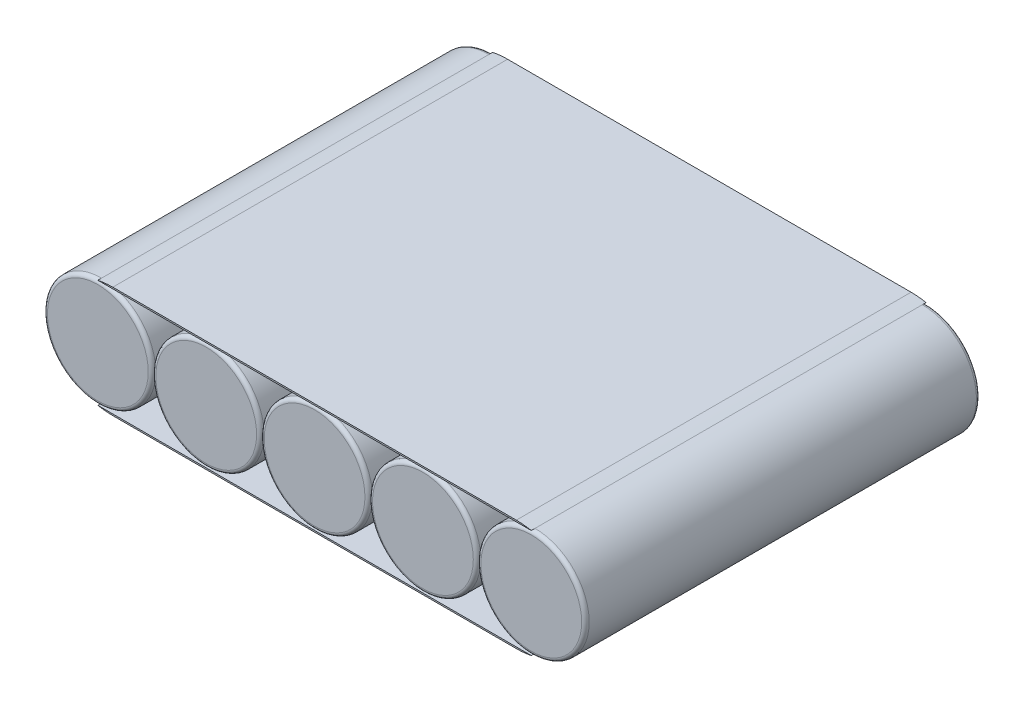
ISO-10303-21;
HEADER;
FILE_DESCRIPTION(('STEP AP214'),'2;1');
FILE_NAME('part.step','',(''),(''),'','','');
FILE_SCHEMA(('AUTOMOTIVE_DESIGN { 1 0 10303 214 1 1 1 1 }'));
ENDSEC;
DATA;
#1=APPLICATION_CONTEXT('core data for automotive mechanical design processes');
#2=APPLICATION_PROTOCOL_DEFINITION('international standard','automotive_design',2000,#1);
#3=PRODUCT_CONTEXT('',#1,'mechanical');
#4=PRODUCT('Part','Part','',(#3));
#5=PRODUCT_RELATED_PRODUCT_CATEGORY('part','',(#4));
#6=PRODUCT_DEFINITION_FORMATION('','',#4);
#7=PRODUCT_DEFINITION_CONTEXT('part definition',#1,'design');
#8=PRODUCT_DEFINITION('design','',#6,#7);
#9=PRODUCT_DEFINITION_SHAPE('','',#8);
#10=(LENGTH_UNIT() NAMED_UNIT(*) SI_UNIT(.MILLI.,.METRE.));
#11=(NAMED_UNIT(*) PLANE_ANGLE_UNIT() SI_UNIT($,.RADIAN.));
#12=(NAMED_UNIT(*) SI_UNIT($,.STERADIAN.) SOLID_ANGLE_UNIT());
#13=UNCERTAINTY_MEASURE_WITH_UNIT(LENGTH_MEASURE(1.E-05),#10,'distance_accuracy_value','');
#14=(GEOMETRIC_REPRESENTATION_CONTEXT(3) GLOBAL_UNCERTAINTY_ASSIGNED_CONTEXT((#13)) GLOBAL_UNIT_ASSIGNED_CONTEXT((#10,
#11,#12)) REPRESENTATION_CONTEXT('',''));
#15=CARTESIAN_POINT('',(0.,0.,0.));
#16=DIRECTION('',(0.,0.,1.));
#17=DIRECTION('',(1.,0.,0.));
#18=AXIS2_PLACEMENT_3D('',#15,#16,#17);
#19=CARTESIAN_POINT('',(-28.82,-7.4,0.));
#20=DIRECTION('',(0.,0.,1.));
#21=DIRECTION('',(1.,0.,0.));
#22=AXIS2_PLACEMENT_3D('',#19,#20,#21);
#23=PLANE('',#22);
#24=DIRECTION('',(1.,0.,0.));
#25=VECTOR('',#24,1.);
#26=CARTESIAN_POINT('',(-28.82,-7.2,0.));
#27=LINE('',#26,#25);
#28=CARTESIAN_POINT('',(-28.82,-7.2,0.));
#29=VERTEX_POINT('',#28);
#30=CARTESIAN_POINT('',(28.82,-7.2,0.));
#31=VERTEX_POINT('',#30);
#32=EDGE_CURVE('E88',#29,#31,#27,.T.);
#33=ORIENTED_EDGE('',*,*,#32,.T.);
#34=CARTESIAN_POINT('',(26.8300251257868,2.6,0.));
#35=DIRECTION('',(0.,0.,1.));
#36=DIRECTION('',(1.,0.,0.));
#37=AXIS2_PLACEMENT_3D('',#34,#35,#36);
#38=CIRCLE('',#37,10.);
#39=CARTESIAN_POINT('',(26.8300251257868,-7.4,0.));
#40=VERTEX_POINT('',#39);
#41=EDGE_CURVE('E12',#31,#40,#38,.F.);
#42=ORIENTED_EDGE('',*,*,#41,.T.);
#43=DIRECTION('',(1.,0.,0.));
#44=VECTOR('',#43,1.);
#45=CARTESIAN_POINT('',(-28.82,-7.4,0.));
#46=LINE('',#45,#44);
#47=CARTESIAN_POINT('',(-26.8300251257868,-7.39999999999999,0.));
#48=VERTEX_POINT('',#47);
#49=EDGE_CURVE('E91',#48,#40,#46,.T.);
#50=ORIENTED_EDGE('',*,*,#49,.F.);
#51=CARTESIAN_POINT('',(-26.8300251257868,2.6,0.));
#52=DIRECTION('',(0.,0.,1.));
#53=DIRECTION('',(1.,0.,0.));
#54=AXIS2_PLACEMENT_3D('',#51,#52,#53);
#55=CIRCLE('',#54,10.);
#56=EDGE_CURVE('E54',#48,#29,#55,.F.);
#57=ORIENTED_EDGE('',*,*,#56,.T.);
#58=EDGE_LOOP('',(#33,#42,#50,#57));
#59=FACE_BOUND('',#58,.T.);
#60=ADVANCED_FACE('F46',(#59),#23,.F.);
#61=CARTESIAN_POINT('',(-28.82,-7.4,52.5));
#62=DIRECTION('',(0.,0.,-1.));
#63=DIRECTION('',(-1.,0.,0.));
#64=AXIS2_PLACEMENT_3D('',#61,#62,#63);
#65=PLANE('',#64);
#66=DIRECTION('',(-1.,0.,0.));
#67=VECTOR('',#66,1.);
#68=CARTESIAN_POINT('',(-28.82,-7.4,52.5));
#69=LINE('',#68,#67);
#70=CARTESIAN_POINT('',(26.8300251257868,-7.4,52.5));
#71=VERTEX_POINT('',#70);
#72=CARTESIAN_POINT('',(-26.8300251257868,-7.4,52.5));
#73=VERTEX_POINT('',#72);
#74=EDGE_CURVE('E106',#71,#73,#69,.T.);
#75=ORIENTED_EDGE('',*,*,#74,.F.);
#76=CARTESIAN_POINT('',(26.8300251257868,2.6,52.5));
#77=DIRECTION('',(0.,0.,-1.));
#78=DIRECTION('',(-1.,0.,0.));
#79=AXIS2_PLACEMENT_3D('',#76,#77,#78);
#80=CIRCLE('',#79,10.);
#81=CARTESIAN_POINT('',(28.82,-7.2,52.5));
#82=VERTEX_POINT('',#81);
#83=EDGE_CURVE('E69',#71,#82,#80,.F.);
#84=ORIENTED_EDGE('',*,*,#83,.T.);
#85=DIRECTION('',(-1.,0.,0.));
#86=VECTOR('',#85,1.);
#87=CARTESIAN_POINT('',(-28.82,-7.2,52.5));
#88=LINE('',#87,#86);
#89=CARTESIAN_POINT('',(-28.82,-7.2,52.5));
#90=VERTEX_POINT('',#89);
#91=EDGE_CURVE('E110',#82,#90,#88,.T.);
#92=ORIENTED_EDGE('',*,*,#91,.T.);
#93=CARTESIAN_POINT('',(-26.8300251257868,2.6,52.5));
#94=DIRECTION('',(0.,0.,-1.));
#95=DIRECTION('',(-1.,0.,0.));
#96=AXIS2_PLACEMENT_3D('',#93,#94,#95);
#97=CIRCLE('',#96,10.);
#98=EDGE_CURVE('E61',#90,#73,#97,.F.);
#99=ORIENTED_EDGE('',*,*,#98,.T.);
#100=EDGE_LOOP('',(#75,#84,#92,#99));
#101=FACE_BOUND('',#100,.T.);
#102=ADVANCED_FACE('F117',(#101),#65,.F.);
#103=CARTESIAN_POINT('',(0.,-7.4,0.));
#104=DIRECTION('',(0.,-1.,0.));
#105=DIRECTION('',(1.,0.,0.));
#106=AXIS2_PLACEMENT_3D('',#103,#104,#105);
#107=PLANE('',#106);
#108=ORIENTED_EDGE('',*,*,#49,.T.);
#109=DIRECTION('',(0.,0.,-1.));
#110=VECTOR('',#109,1.);
#111=CARTESIAN_POINT('',(26.8300251257868,-7.4,52.5));
#112=LINE('',#111,#110);
#113=EDGE_CURVE('E114',#40,#71,#112,.F.);
#114=ORIENTED_EDGE('',*,*,#113,.T.);
#115=ORIENTED_EDGE('',*,*,#74,.T.);
#116=DIRECTION('',(0.,0.,1.));
#117=VECTOR('',#116,1.);
#118=CARTESIAN_POINT('',(-26.8300251257868,-7.4,0.));
#119=LINE('',#118,#117);
#120=EDGE_CURVE('E112',#73,#48,#119,.F.);
#121=ORIENTED_EDGE('',*,*,#120,.T.);
#122=EDGE_LOOP('',(#108,#114,#115,#121));
#123=FACE_BOUND('',#122,.T.);
#124=ADVANCED_FACE('F120',(#123),#107,.T.);
#125=CARTESIAN_POINT('',(0.,-7.2,0.));
#126=DIRECTION('',(0.,-1.,0.));
#127=DIRECTION('',(1.,0.,0.));
#128=AXIS2_PLACEMENT_3D('',#125,#126,#127);
#129=PLANE('',#128);
#130=DIRECTION('',(0.,0.,-1.));
#131=VECTOR('',#130,1.);
#132=CARTESIAN_POINT('',(-28.82,-7.2,52.5));
#133=LINE('',#132,#131);
#134=EDGE_CURVE('E100',#90,#29,#133,.T.);
#135=ORIENTED_EDGE('',*,*,#134,.F.);
#136=ORIENTED_EDGE('',*,*,#91,.F.);
#137=DIRECTION('',(0.,0.,1.));
#138=VECTOR('',#137,1.);
#139=CARTESIAN_POINT('',(28.82,-7.2,52.5));
#140=LINE('',#139,#138);
#141=EDGE_CURVE('E101',#31,#82,#140,.T.);
#142=ORIENTED_EDGE('',*,*,#141,.F.);
#143=ORIENTED_EDGE('',*,*,#32,.F.);
#144=EDGE_LOOP('',(#135,#136,#142,#143));
#145=FACE_BOUND('',#144,.T.);
#146=ADVANCED_FACE('F98',(#145),#129,.F.);
#147=CARTESIAN_POINT('',(26.8300251257868,2.6,52.5));
#148=DIRECTION('',(0.,0.,1.));
#149=DIRECTION('',(0.,-1.,0.));
#150=AXIS2_PLACEMENT_3D('',#147,#148,#149);
#151=CYLINDRICAL_SURFACE('',#150,10.);
#152=ORIENTED_EDGE('',*,*,#41,.F.);
#153=ORIENTED_EDGE('',*,*,#141,.T.);
#154=ORIENTED_EDGE('',*,*,#83,.F.);
#155=ORIENTED_EDGE('',*,*,#113,.F.);
#156=EDGE_LOOP('',(#152,#153,#154,#155));
#157=FACE_BOUND('',#156,.T.);
#158=ADVANCED_FACE('F118',(#157),#151,.T.);
#159=CARTESIAN_POINT('',(-26.8300251257868,2.6,52.5));
#160=DIRECTION('',(0.,0.,-1.));
#161=DIRECTION('',(-1.,0.,0.));
#162=AXIS2_PLACEMENT_3D('',#159,#160,#161);
#163=CYLINDRICAL_SURFACE('',#162,10.);
#164=ORIENTED_EDGE('',*,*,#98,.F.);
#165=ORIENTED_EDGE('',*,*,#134,.T.);
#166=ORIENTED_EDGE('',*,*,#56,.F.);
#167=ORIENTED_EDGE('',*,*,#120,.F.);
#168=EDGE_LOOP('',(#164,#165,#166,#167));
#169=FACE_BOUND('',#168,.T.);
#170=ADVANCED_FACE('F48',(#169),#163,.T.);
#171=CLOSED_SHELL('',(#60,#102,#124,#146,#158,#170));
#172=MANIFOLD_SOLID_BREP('B2',#171);
#173=CARTESIAN_POINT('',(-28.82,7.4,52.5));
#174=DIRECTION('',(0.,0.,-1.));
#175=DIRECTION('',(-1.,0.,0.));
#176=AXIS2_PLACEMENT_3D('',#173,#174,#175);
#177=PLANE('',#176);
#178=DIRECTION('',(1.,0.,0.));
#179=VECTOR('',#178,1.);
#180=CARTESIAN_POINT('',(-28.82,7.4,52.5));
#181=LINE('',#180,#179);
#182=CARTESIAN_POINT('',(-26.8300251257868,7.4,52.5));
#183=VERTEX_POINT('',#182);
#184=CARTESIAN_POINT('',(26.8300251257868,7.4,52.5));
#185=VERTEX_POINT('',#184);
#186=EDGE_CURVE('E222',#183,#185,#181,.T.);
#187=ORIENTED_EDGE('',*,*,#186,.F.);
#188=CARTESIAN_POINT('',(-26.8300251257868,-2.6,52.5));
#189=DIRECTION('',(0.,0.,-1.));
#190=DIRECTION('',(-1.,0.,0.));
#191=AXIS2_PLACEMENT_3D('',#188,#189,#190);
#192=CIRCLE('',#191,10.);
#193=CARTESIAN_POINT('',(-28.82,7.2,52.5));
#194=VERTEX_POINT('',#193);
#195=EDGE_CURVE('E217',#183,#194,#192,.F.);
#196=ORIENTED_EDGE('',*,*,#195,.T.);
#197=DIRECTION('',(1.,0.,0.));
#198=VECTOR('',#197,1.);
#199=CARTESIAN_POINT('',(-28.82,7.2,52.5));
#200=LINE('',#199,#198);
#201=CARTESIAN_POINT('',(28.82,7.2,52.5));
#202=VERTEX_POINT('',#201);
#203=EDGE_CURVE('E219',#194,#202,#200,.T.);
#204=ORIENTED_EDGE('',*,*,#203,.T.);
#205=CARTESIAN_POINT('',(26.8300251257868,-2.6,52.5));
#206=DIRECTION('',(0.,0.,-1.));
#207=DIRECTION('',(-1.,0.,0.));
#208=AXIS2_PLACEMENT_3D('',#205,#206,#207);
#209=CIRCLE('',#208,10.);
#210=EDGE_CURVE('E227',#202,#185,#209,.F.);
#211=ORIENTED_EDGE('',*,*,#210,.T.);
#212=EDGE_LOOP('',(#187,#196,#204,#211));
#213=FACE_BOUND('',#212,.T.);
#214=ADVANCED_FACE('F178',(#213),#177,.F.);
#215=CARTESIAN_POINT('',(-28.82,7.4,0.));
#216=DIRECTION('',(0.,0.,1.));
#217=DIRECTION('',(1.,0.,0.));
#218=AXIS2_PLACEMENT_3D('',#215,#216,#217);
#219=PLANE('',#218);
#220=DIRECTION('',(-1.,0.,0.));
#221=VECTOR('',#220,1.);
#222=CARTESIAN_POINT('',(-28.82,7.2,0.));
#223=LINE('',#222,#221);
#224=CARTESIAN_POINT('',(28.82,7.2,0.));
#225=VERTEX_POINT('',#224);
#226=CARTESIAN_POINT('',(-28.82,7.2,0.));
#227=VERTEX_POINT('',#226);
#228=EDGE_CURVE('E244',#225,#227,#223,.T.);
#229=ORIENTED_EDGE('',*,*,#228,.T.);
#230=CARTESIAN_POINT('',(-26.8300251257868,-2.6,0.));
#231=DIRECTION('',(0.,0.,1.));
#232=DIRECTION('',(1.,0.,0.));
#233=AXIS2_PLACEMENT_3D('',#230,#231,#232);
#234=CIRCLE('',#233,10.);
#235=CARTESIAN_POINT('',(-26.8300251257868,7.4,0.));
#236=VERTEX_POINT('',#235);
#237=EDGE_CURVE('E44',#227,#236,#234,.F.);
#238=ORIENTED_EDGE('',*,*,#237,.T.);
#239=DIRECTION('',(-1.,0.,0.));
#240=VECTOR('',#239,1.);
#241=CARTESIAN_POINT('',(-28.82,7.4,0.));
#242=LINE('',#241,#240);
#243=CARTESIAN_POINT('',(26.8300251257868,7.4,0.));
#244=VERTEX_POINT('',#243);
#245=EDGE_CURVE('E240',#244,#236,#242,.T.);
#246=ORIENTED_EDGE('',*,*,#245,.F.);
#247=CARTESIAN_POINT('',(26.8300251257868,-2.6,0.));
#248=DIRECTION('',(0.,0.,1.));
#249=DIRECTION('',(1.,0.,0.));
#250=AXIS2_PLACEMENT_3D('',#247,#248,#249);
#251=CIRCLE('',#250,10.);
#252=EDGE_CURVE('E186',#244,#225,#251,.F.);
#253=ORIENTED_EDGE('',*,*,#252,.T.);
#254=EDGE_LOOP('',(#229,#238,#246,#253));
#255=FACE_BOUND('',#254,.T.);
#256=ADVANCED_FACE('F250',(#255),#219,.F.);
#257=CARTESIAN_POINT('',(0.,7.4,0.));
#258=DIRECTION('',(0.,1.,0.));
#259=DIRECTION('',(-1.,0.,0.));
#260=AXIS2_PLACEMENT_3D('',#257,#258,#259);
#261=PLANE('',#260);
#262=ORIENTED_EDGE('',*,*,#245,.T.);
#263=DIRECTION('',(0.,0.,-1.));
#264=VECTOR('',#263,1.);
#265=CARTESIAN_POINT('',(-26.8300251257868,7.4,52.5));
#266=LINE('',#265,#264);
#267=EDGE_CURVE('E248',#236,#183,#266,.F.);
#268=ORIENTED_EDGE('',*,*,#267,.T.);
#269=ORIENTED_EDGE('',*,*,#186,.T.);
#270=DIRECTION('',(0.,0.,1.));
#271=VECTOR('',#270,1.);
#272=CARTESIAN_POINT('',(26.8300251257868,7.4,0.));
#273=LINE('',#272,#271);
#274=EDGE_CURVE('E246',#185,#244,#273,.F.);
#275=ORIENTED_EDGE('',*,*,#274,.T.);
#276=EDGE_LOOP('',(#262,#268,#269,#275));
#277=FACE_BOUND('',#276,.T.);
#278=ADVANCED_FACE('F252',(#277),#261,.T.);
#279=CARTESIAN_POINT('',(0.,7.2,0.));
#280=DIRECTION('',(0.,1.,0.));
#281=DIRECTION('',(-1.,0.,0.));
#282=AXIS2_PLACEMENT_3D('',#279,#280,#281);
#283=PLANE('',#282);
#284=DIRECTION('',(0.,0.,1.));
#285=VECTOR('',#284,1.);
#286=CARTESIAN_POINT('',(-28.82,7.2,0.));
#287=LINE('',#286,#285);
#288=EDGE_CURVE('E233',#227,#194,#287,.T.);
#289=ORIENTED_EDGE('',*,*,#288,.F.);
#290=ORIENTED_EDGE('',*,*,#228,.F.);
#291=DIRECTION('',(0.,0.,-1.));
#292=VECTOR('',#291,1.);
#293=CARTESIAN_POINT('',(28.82,7.2,0.));
#294=LINE('',#293,#292);
#295=EDGE_CURVE('E234',#202,#225,#294,.T.);
#296=ORIENTED_EDGE('',*,*,#295,.F.);
#297=ORIENTED_EDGE('',*,*,#203,.F.);
#298=EDGE_LOOP('',(#289,#290,#296,#297));
#299=FACE_BOUND('',#298,.T.);
#300=ADVANCED_FACE('F231',(#299),#283,.F.);
#301=CARTESIAN_POINT('',(-26.8300251257868,-2.6,0.));
#302=DIRECTION('',(0.,0.,1.));
#303=DIRECTION('',(1.,0.,0.));
#304=AXIS2_PLACEMENT_3D('',#301,#302,#303);
#305=CYLINDRICAL_SURFACE('',#304,10.);
#306=ORIENTED_EDGE('',*,*,#237,.F.);
#307=ORIENTED_EDGE('',*,*,#288,.T.);
#308=ORIENTED_EDGE('',*,*,#195,.F.);
#309=ORIENTED_EDGE('',*,*,#267,.F.);
#310=EDGE_LOOP('',(#306,#307,#308,#309));
#311=FACE_BOUND('',#310,.T.);
#312=ADVANCED_FACE('F237',(#311),#305,.T.);
#313=CARTESIAN_POINT('',(26.8300251257868,-2.6,0.));
#314=DIRECTION('',(0.,0.,-1.));
#315=DIRECTION('',(-1.,0.,0.));
#316=AXIS2_PLACEMENT_3D('',#313,#314,#315);
#317=CYLINDRICAL_SURFACE('',#316,10.);
#318=ORIENTED_EDGE('',*,*,#210,.F.);
#319=ORIENTED_EDGE('',*,*,#295,.T.);
#320=ORIENTED_EDGE('',*,*,#252,.F.);
#321=ORIENTED_EDGE('',*,*,#274,.F.);
#322=EDGE_LOOP('',(#318,#319,#320,#321));
#323=FACE_BOUND('',#322,.T.);
#324=ADVANCED_FACE('F180',(#323),#317,.T.);
#325=CLOSED_SHELL('',(#214,#256,#278,#300,#312,#324));
#326=MANIFOLD_SOLID_BREP('B6',#325);
#327=CARTESIAN_POINT('',(28.82,0.,52.5));
#328=DIRECTION('',(0.,0.,-1.));
#329=DIRECTION('',(-1.,0.,0.));
#330=AXIS2_PLACEMENT_3D('',#327,#328,#329);
#331=CYLINDRICAL_SURFACE('',#330,7.2);
#332=CARTESIAN_POINT('',(28.82,0.,52.));
#333=DIRECTION('',(0.,0.,1.));
#334=DIRECTION('',(1.,0.,0.));
#335=AXIS2_PLACEMENT_3D('',#332,#333,#334);
#336=CIRCLE('',#335,7.2);
#337=CARTESIAN_POINT('',(36.02,0.,52.));
#338=VERTEX_POINT('',#337);
#339=EDGE_CURVE('E317',#338,#338,#336,.F.);
#340=ORIENTED_EDGE('',*,*,#339,.T.);
#341=EDGE_LOOP('',(#340));
#342=FACE_BOUND('',#341,.T.);
#343=CARTESIAN_POINT('',(28.82,0.,0.5));
#344=DIRECTION('',(0.,0.,1.));
#345=DIRECTION('',(1.,0.,0.));
#346=AXIS2_PLACEMENT_3D('',#343,#344,#345);
#347=CIRCLE('',#346,7.2);
#348=CARTESIAN_POINT('',(36.02,0.,0.5));
#349=VERTEX_POINT('',#348);
#350=EDGE_CURVE('E321',#349,#349,#347,.T.);
#351=ORIENTED_EDGE('',*,*,#350,.T.);
#352=EDGE_LOOP('',(#351));
#353=FACE_BOUND('',#352,.T.);
#354=ADVANCED_FACE('F310',(#342,#353),#331,.T.);
#355=CARTESIAN_POINT('',(28.82,0.,52.5));
#356=DIRECTION('',(0.,0.,1.));
#357=DIRECTION('',(1.,0.,0.));
#358=AXIS2_PLACEMENT_3D('',#355,#356,#357);
#359=PLANE('',#358);
#360=CARTESIAN_POINT('',(28.82,0.,52.5));
#361=DIRECTION('',(0.,0.,1.));
#362=DIRECTION('',(1.,0.,0.));
#363=AXIS2_PLACEMENT_3D('',#360,#361,#362);
#364=CIRCLE('',#363,6.7);
#365=CARTESIAN_POINT('',(35.52,0.,52.5));
#366=VERTEX_POINT('',#365);
#367=EDGE_CURVE('E325',#366,#366,#364,.T.);
#368=ORIENTED_EDGE('',*,*,#367,.T.);
#369=EDGE_LOOP('',(#368));
#370=FACE_BOUND('',#369,.T.);
#371=ADVANCED_FACE('F331',(#370),#359,.T.);
#372=CARTESIAN_POINT('',(28.82,0.,0.));
#373=DIRECTION('',(0.,0.,1.));
#374=DIRECTION('',(1.,0.,0.));
#375=AXIS2_PLACEMENT_3D('',#372,#373,#374);
#376=PLANE('',#375);
#377=CARTESIAN_POINT('',(28.82,0.,0.));
#378=DIRECTION('',(0.,0.,1.));
#379=DIRECTION('',(1.,0.,0.));
#380=AXIS2_PLACEMENT_3D('',#377,#378,#379);
#381=CIRCLE('',#380,6.7);
#382=CARTESIAN_POINT('',(35.52,0.,0.));
#383=VERTEX_POINT('',#382);
#384=EDGE_CURVE('E177',#383,#383,#381,.F.);
#385=ORIENTED_EDGE('',*,*,#384,.T.);
#386=EDGE_LOOP('',(#385));
#387=FACE_BOUND('',#386,.T.);
#388=ADVANCED_FACE('F335',(#387),#376,.F.);
#389=CARTESIAN_POINT('',(28.82,0.,52.));
#390=DIRECTION('',(0.,0.,1.));
#391=DIRECTION('',(1.,0.,0.));
#392=AXIS2_PLACEMENT_3D('',#389,#390,#391);
#393=TOROIDAL_SURFACE('',#392,6.7,0.5);
#394=ORIENTED_EDGE('',*,*,#339,.F.);
#395=EDGE_LOOP('',(#394));
#396=FACE_BOUND('',#395,.T.);
#397=ORIENTED_EDGE('',*,*,#367,.F.);
#398=EDGE_LOOP('',(#397));
#399=FACE_BOUND('',#398,.T.);
#400=ADVANCED_FACE('F333',(#396,#399),#393,.T.);
#401=CARTESIAN_POINT('',(28.82,0.,0.5));
#402=DIRECTION('',(0.,0.,1.));
#403=DIRECTION('',(1.,0.,0.));
#404=AXIS2_PLACEMENT_3D('',#401,#402,#403);
#405=TOROIDAL_SURFACE('',#404,6.7,0.5);
#406=ORIENTED_EDGE('',*,*,#384,.F.);
#407=EDGE_LOOP('',(#406));
#408=FACE_BOUND('',#407,.T.);
#409=ORIENTED_EDGE('',*,*,#350,.F.);
#410=EDGE_LOOP('',(#409));
#411=FACE_BOUND('',#410,.T.);
#412=ADVANCED_FACE('F312',(#408,#411),#405,.T.);
#413=CLOSED_SHELL('',(#354,#371,#388,#400,#412));
#414=MANIFOLD_SOLID_BREP('B38',#413);
#415=CARTESIAN_POINT('',(14.41,0.,52.5));
#416=DIRECTION('',(0.,0.,-1.));
#417=DIRECTION('',(-1.,0.,0.));
#418=AXIS2_PLACEMENT_3D('',#415,#416,#417);
#419=CYLINDRICAL_SURFACE('',#418,7.2);
#420=CARTESIAN_POINT('',(14.41,0.,0.5));
#421=DIRECTION('',(0.,0.,1.));
#422=DIRECTION('',(1.,0.,0.));
#423=AXIS2_PLACEMENT_3D('',#420,#421,#422);
#424=CIRCLE('',#423,7.2);
#425=CARTESIAN_POINT('',(21.61,0.,0.5));
#426=VERTEX_POINT('',#425);
#427=EDGE_CURVE('E400',#426,#426,#424,.T.);
#428=ORIENTED_EDGE('',*,*,#427,.T.);
#429=EDGE_LOOP('',(#428));
#430=FACE_BOUND('',#429,.T.);
#431=CARTESIAN_POINT('',(14.41,0.,52.));
#432=DIRECTION('',(0.,0.,1.));
#433=DIRECTION('',(1.,0.,0.));
#434=AXIS2_PLACEMENT_3D('',#431,#432,#433);
#435=CIRCLE('',#434,7.2);
#436=CARTESIAN_POINT('',(21.61,0.,52.));
#437=VERTEX_POINT('',#436);
#438=EDGE_CURVE('E404',#437,#437,#435,.F.);
#439=ORIENTED_EDGE('',*,*,#438,.T.);
#440=EDGE_LOOP('',(#439));
#441=FACE_BOUND('',#440,.T.);
#442=ADVANCED_FACE('F389',(#430,#441),#419,.T.);
#443=CARTESIAN_POINT('',(14.41,0.,52.5));
#444=DIRECTION('',(0.,0.,1.));
#445=DIRECTION('',(1.,0.,0.));
#446=AXIS2_PLACEMENT_3D('',#443,#444,#445);
#447=PLANE('',#446);
#448=CARTESIAN_POINT('',(14.41,0.,52.5));
#449=DIRECTION('',(0.,0.,1.));
#450=DIRECTION('',(1.,0.,0.));
#451=AXIS2_PLACEMENT_3D('',#448,#449,#450);
#452=CIRCLE('',#451,6.7);
#453=CARTESIAN_POINT('',(21.11,0.,52.5));
#454=VERTEX_POINT('',#453);
#455=EDGE_CURVE('E309',#454,#454,#452,.T.);
#456=ORIENTED_EDGE('',*,*,#455,.T.);
#457=EDGE_LOOP('',(#456));
#458=FACE_BOUND('',#457,.T.);
#459=ADVANCED_FACE('F420',(#458),#447,.T.);
#460=CARTESIAN_POINT('',(14.41,0.,0.));
#461=DIRECTION('',(0.,0.,1.));
#462=DIRECTION('',(1.,0.,0.));
#463=AXIS2_PLACEMENT_3D('',#460,#461,#462);
#464=PLANE('',#463);
#465=CARTESIAN_POINT('',(14.41,0.,0.));
#466=DIRECTION('',(0.,0.,1.));
#467=DIRECTION('',(1.,0.,0.));
#468=AXIS2_PLACEMENT_3D('',#465,#466,#467);
#469=CIRCLE('',#468,6.7);
#470=CARTESIAN_POINT('',(21.11,0.,0.));
#471=VERTEX_POINT('',#470);
#472=EDGE_CURVE('E396',#471,#471,#469,.F.);
#473=ORIENTED_EDGE('',*,*,#472,.T.);
#474=EDGE_LOOP('',(#473));
#475=FACE_BOUND('',#474,.T.);
#476=ADVANCED_FACE('F417',(#475),#464,.F.);
#477=CARTESIAN_POINT('',(14.41,0.,0.5));
#478=DIRECTION('',(0.,0.,1.));
#479=DIRECTION('',(1.,0.,0.));
#480=AXIS2_PLACEMENT_3D('',#477,#478,#479);
#481=TOROIDAL_SURFACE('',#480,6.7,0.5);
#482=ORIENTED_EDGE('',*,*,#472,.F.);
#483=EDGE_LOOP('',(#482));
#484=FACE_BOUND('',#483,.T.);
#485=ORIENTED_EDGE('',*,*,#427,.F.);
#486=EDGE_LOOP('',(#485));
#487=FACE_BOUND('',#486,.T.);
#488=ADVANCED_FACE('F413',(#484,#487),#481,.T.);
#489=CARTESIAN_POINT('',(14.41,0.,52.));
#490=DIRECTION('',(0.,0.,1.));
#491=DIRECTION('',(1.,0.,0.));
#492=AXIS2_PLACEMENT_3D('',#489,#490,#491);
#493=TOROIDAL_SURFACE('',#492,6.7,0.5);
#494=ORIENTED_EDGE('',*,*,#438,.F.);
#495=EDGE_LOOP('',(#494));
#496=FACE_BOUND('',#495,.T.);
#497=ORIENTED_EDGE('',*,*,#455,.F.);
#498=EDGE_LOOP('',(#497));
#499=FACE_BOUND('',#498,.T.);
#500=ADVANCED_FACE('F391',(#496,#499),#493,.T.);
#501=CLOSED_SHELL('',(#442,#459,#476,#488,#500));
#502=MANIFOLD_SOLID_BREP('B172',#501);
#503=CARTESIAN_POINT('',(-28.82,0.,52.5));
#504=DIRECTION('',(0.,0.,-1.));
#505=DIRECTION('',(-1.,0.,0.));
#506=AXIS2_PLACEMENT_3D('',#503,#504,#505);
#507=CYLINDRICAL_SURFACE('',#506,7.2);
#508=CARTESIAN_POINT('',(-28.82,0.,0.5));
#509=DIRECTION('',(0.,0.,1.));
#510=DIRECTION('',(1.,0.,0.));
#511=AXIS2_PLACEMENT_3D('',#508,#509,#510);
#512=CIRCLE('',#511,7.2);
#513=CARTESIAN_POINT('',(-21.62,0.,0.5));
#514=VERTEX_POINT('',#513);
#515=EDGE_CURVE('E479',#514,#514,#512,.T.);
#516=ORIENTED_EDGE('',*,*,#515,.T.);
#517=EDGE_LOOP('',(#516));
#518=FACE_BOUND('',#517,.T.);
#519=CARTESIAN_POINT('',(-28.82,0.,52.));
#520=DIRECTION('',(0.,0.,1.));
#521=DIRECTION('',(1.,0.,0.));
#522=AXIS2_PLACEMENT_3D('',#519,#520,#521);
#523=CIRCLE('',#522,7.2);
#524=CARTESIAN_POINT('',(-21.62,0.,52.));
#525=VERTEX_POINT('',#524);
#526=EDGE_CURVE('E483',#525,#525,#523,.F.);
#527=ORIENTED_EDGE('',*,*,#526,.T.);
#528=EDGE_LOOP('',(#527));
#529=FACE_BOUND('',#528,.T.);
#530=ADVANCED_FACE('F468',(#518,#529),#507,.T.);
#531=CARTESIAN_POINT('',(-28.82,0.,52.5));
#532=DIRECTION('',(0.,0.,1.));
#533=DIRECTION('',(1.,0.,0.));
#534=AXIS2_PLACEMENT_3D('',#531,#532,#533);
#535=PLANE('',#534);
#536=CARTESIAN_POINT('',(-28.82,0.,52.5));
#537=DIRECTION('',(0.,0.,1.));
#538=DIRECTION('',(1.,0.,0.));
#539=AXIS2_PLACEMENT_3D('',#536,#537,#538);
#540=CIRCLE('',#539,6.7);
#541=CARTESIAN_POINT('',(-22.12,0.,52.5));
#542=VERTEX_POINT('',#541);
#543=EDGE_CURVE('E388',#542,#542,#540,.T.);
#544=ORIENTED_EDGE('',*,*,#543,.T.);
#545=EDGE_LOOP('',(#544));
#546=FACE_BOUND('',#545,.T.);
#547=ADVANCED_FACE('F499',(#546),#535,.T.);
#548=CARTESIAN_POINT('',(-28.82,0.,0.));
#549=DIRECTION('',(0.,0.,1.));
#550=DIRECTION('',(1.,0.,0.));
#551=AXIS2_PLACEMENT_3D('',#548,#549,#550);
#552=PLANE('',#551);
#553=CARTESIAN_POINT('',(-28.82,0.,0.));
#554=DIRECTION('',(0.,0.,1.));
#555=DIRECTION('',(1.,0.,0.));
#556=AXIS2_PLACEMENT_3D('',#553,#554,#555);
#557=CIRCLE('',#556,6.7);
#558=CARTESIAN_POINT('',(-22.12,0.,0.));
#559=VERTEX_POINT('',#558);
#560=EDGE_CURVE('E475',#559,#559,#557,.F.);
#561=ORIENTED_EDGE('',*,*,#560,.T.);
#562=EDGE_LOOP('',(#561));
#563=FACE_BOUND('',#562,.T.);
#564=ADVANCED_FACE('F496',(#563),#552,.F.);
#565=CARTESIAN_POINT('',(-28.82,0.,0.5));
#566=DIRECTION('',(0.,0.,1.));
#567=DIRECTION('',(1.,0.,0.));
#568=AXIS2_PLACEMENT_3D('',#565,#566,#567);
#569=TOROIDAL_SURFACE('',#568,6.7,0.5);
#570=ORIENTED_EDGE('',*,*,#560,.F.);
#571=EDGE_LOOP('',(#570));
#572=FACE_BOUND('',#571,.T.);
#573=ORIENTED_EDGE('',*,*,#515,.F.);
#574=EDGE_LOOP('',(#573));
#575=FACE_BOUND('',#574,.T.);
#576=ADVANCED_FACE('F492',(#572,#575),#569,.T.);
#577=CARTESIAN_POINT('',(-28.82,0.,52.));
#578=DIRECTION('',(0.,0.,1.));
#579=DIRECTION('',(1.,0.,0.));
#580=AXIS2_PLACEMENT_3D('',#577,#578,#579);
#581=TOROIDAL_SURFACE('',#580,6.7,0.5);
#582=ORIENTED_EDGE('',*,*,#526,.F.);
#583=EDGE_LOOP('',(#582));
#584=FACE_BOUND('',#583,.T.);
#585=ORIENTED_EDGE('',*,*,#543,.F.);
#586=EDGE_LOOP('',(#585));
#587=FACE_BOUND('',#586,.T.);
#588=ADVANCED_FACE('F470',(#584,#587),#581,.T.);
#589=CLOSED_SHELL('',(#530,#547,#564,#576,#588));
#590=MANIFOLD_SOLID_BREP('B304',#589);
#591=CARTESIAN_POINT('',(-14.41,0.,52.5));
#592=DIRECTION('',(0.,0.,-1.));
#593=DIRECTION('',(-1.,0.,0.));
#594=AXIS2_PLACEMENT_3D('',#591,#592,#593);
#595=CYLINDRICAL_SURFACE('',#594,7.2);
#596=CARTESIAN_POINT('',(-14.41,0.,52.));
#597=DIRECTION('',(0.,0.,1.));
#598=DIRECTION('',(1.,0.,0.));
#599=AXIS2_PLACEMENT_3D('',#596,#597,#598);
#600=CIRCLE('',#599,7.2);
#601=CARTESIAN_POINT('',(-7.21,0.,52.));
#602=VERTEX_POINT('',#601);
#603=EDGE_CURVE('E553',#602,#602,#600,.F.);
#604=ORIENTED_EDGE('',*,*,#603,.T.);
#605=EDGE_LOOP('',(#604));
#606=FACE_BOUND('',#605,.T.);
#607=CARTESIAN_POINT('',(-14.41,0.,0.5));
#608=DIRECTION('',(0.,0.,1.));
#609=DIRECTION('',(1.,0.,0.));
#610=AXIS2_PLACEMENT_3D('',#607,#608,#609);
#611=CIRCLE('',#610,7.2);
#612=CARTESIAN_POINT('',(-7.21,0.,0.5));
#613=VERTEX_POINT('',#612);
#614=EDGE_CURVE('E557',#613,#613,#611,.T.);
#615=ORIENTED_EDGE('',*,*,#614,.T.);
#616=EDGE_LOOP('',(#615));
#617=FACE_BOUND('',#616,.T.);
#618=ADVANCED_FACE('F546',(#606,#617),#595,.T.);
#619=CARTESIAN_POINT('',(-14.41,0.,52.5));
#620=DIRECTION('',(0.,0.,1.));
#621=DIRECTION('',(1.,0.,0.));
#622=AXIS2_PLACEMENT_3D('',#619,#620,#621);
#623=PLANE('',#622);
#624=CARTESIAN_POINT('',(-14.41,0.,52.5));
#625=DIRECTION('',(0.,0.,1.));
#626=DIRECTION('',(1.,0.,0.));
#627=AXIS2_PLACEMENT_3D('',#624,#625,#626);
#628=CIRCLE('',#627,6.7);
#629=CARTESIAN_POINT('',(-7.71,0.,52.5));
#630=VERTEX_POINT('',#629);
#631=EDGE_CURVE('E561',#630,#630,#628,.T.);
#632=ORIENTED_EDGE('',*,*,#631,.T.);
#633=EDGE_LOOP('',(#632));
#634=FACE_BOUND('',#633,.T.);
#635=ADVANCED_FACE('F567',(#634),#623,.T.);
#636=CARTESIAN_POINT('',(-14.41,0.,0.));
#637=DIRECTION('',(0.,0.,1.));
#638=DIRECTION('',(1.,0.,0.));
#639=AXIS2_PLACEMENT_3D('',#636,#637,#638);
#640=PLANE('',#639);
#641=CARTESIAN_POINT('',(-14.41,0.,0.));
#642=DIRECTION('',(0.,0.,1.));
#643=DIRECTION('',(1.,0.,0.));
#644=AXIS2_PLACEMENT_3D('',#641,#642,#643);
#645=CIRCLE('',#644,6.7);
#646=CARTESIAN_POINT('',(-7.71,0.,0.));
#647=VERTEX_POINT('',#646);
#648=EDGE_CURVE('E467',#647,#647,#645,.F.);
#649=ORIENTED_EDGE('',*,*,#648,.T.);
#650=EDGE_LOOP('',(#649));
#651=FACE_BOUND('',#650,.T.);
#652=ADVANCED_FACE('F571',(#651),#640,.F.);
#653=CARTESIAN_POINT('',(-14.41,0.,52.));
#654=DIRECTION('',(0.,0.,1.));
#655=DIRECTION('',(1.,0.,0.));
#656=AXIS2_PLACEMENT_3D('',#653,#654,#655);
#657=TOROIDAL_SURFACE('',#656,6.7,0.5);
#658=ORIENTED_EDGE('',*,*,#603,.F.);
#659=EDGE_LOOP('',(#658));
#660=FACE_BOUND('',#659,.T.);
#661=ORIENTED_EDGE('',*,*,#631,.F.);
#662=EDGE_LOOP('',(#661));
#663=FACE_BOUND('',#662,.T.);
#664=ADVANCED_FACE('F569',(#660,#663),#657,.T.);
#665=CARTESIAN_POINT('',(-14.41,0.,0.5));
#666=DIRECTION('',(0.,0.,1.));
#667=DIRECTION('',(1.,0.,0.));
#668=AXIS2_PLACEMENT_3D('',#665,#666,#667);
#669=TOROIDAL_SURFACE('',#668,6.7,0.5);
#670=ORIENTED_EDGE('',*,*,#648,.F.);
#671=EDGE_LOOP('',(#670));
#672=FACE_BOUND('',#671,.T.);
#673=ORIENTED_EDGE('',*,*,#614,.F.);
#674=EDGE_LOOP('',(#673));
#675=FACE_BOUND('',#674,.T.);
#676=ADVANCED_FACE('F548',(#672,#675),#669,.T.);
#677=CLOSED_SHELL('',(#618,#635,#652,#664,#676));
#678=MANIFOLD_SOLID_BREP('B383',#677);
#679=CARTESIAN_POINT('',(0.,0.,52.5));
#680=DIRECTION('',(0.,0.,-1.));
#681=DIRECTION('',(-1.,0.,0.));
#682=AXIS2_PLACEMENT_3D('',#679,#680,#681);
#683=CYLINDRICAL_SURFACE('',#682,7.2);
#684=CARTESIAN_POINT('',(0.,0.,0.5));
#685=DIRECTION('',(0.,0.,1.));
#686=DIRECTION('',(1.,0.,0.));
#687=AXIS2_PLACEMENT_3D('',#684,#685,#686);
#688=CIRCLE('',#687,7.2);
#689=CARTESIAN_POINT('',(7.2,0.,0.5));
#690=VERTEX_POINT('',#689);
#691=EDGE_CURVE('E628',#690,#690,#688,.T.);
#692=ORIENTED_EDGE('',*,*,#691,.T.);
#693=EDGE_LOOP('',(#692));
#694=FACE_BOUND('',#693,.T.);
#695=CARTESIAN_POINT('',(0.,0.,52.));
#696=DIRECTION('',(0.,0.,1.));
#697=DIRECTION('',(1.,0.,0.));
#698=AXIS2_PLACEMENT_3D('',#695,#696,#697);
#699=CIRCLE('',#698,7.2);
#700=CARTESIAN_POINT('',(7.2,0.,52.));
#701=VERTEX_POINT('',#700);
#702=EDGE_CURVE('E632',#701,#701,#699,.F.);
#703=ORIENTED_EDGE('',*,*,#702,.T.);
#704=EDGE_LOOP('',(#703));
#705=FACE_BOUND('',#704,.T.);
#706=ADVANCED_FACE('F617',(#694,#705),#683,.T.);
#707=CARTESIAN_POINT('',(0.,0.,52.5));
#708=DIRECTION('',(0.,0.,1.));
#709=DIRECTION('',(1.,0.,0.));
#710=AXIS2_PLACEMENT_3D('',#707,#708,#709);
#711=PLANE('',#710);
#712=CARTESIAN_POINT('',(0.,0.,52.5));
#713=DIRECTION('',(0.,0.,1.));
#714=DIRECTION('',(1.,0.,0.));
#715=AXIS2_PLACEMENT_3D('',#712,#713,#714);
#716=CIRCLE('',#715,6.7);
#717=CARTESIAN_POINT('',(6.7,0.,52.5));
#718=VERTEX_POINT('',#717);
#719=EDGE_CURVE('E545',#718,#718,#716,.T.);
#720=ORIENTED_EDGE('',*,*,#719,.T.);
#721=EDGE_LOOP('',(#720));
#722=FACE_BOUND('',#721,.T.);
#723=ADVANCED_FACE('F648',(#722),#711,.T.);
#724=CARTESIAN_POINT('',(0.,0.,0.));
#725=DIRECTION('',(0.,0.,1.));
#726=DIRECTION('',(1.,0.,0.));
#727=AXIS2_PLACEMENT_3D('',#724,#725,#726);
#728=PLANE('',#727);
#729=CARTESIAN_POINT('',(0.,0.,0.));
#730=DIRECTION('',(0.,0.,1.));
#731=DIRECTION('',(1.,0.,0.));
#732=AXIS2_PLACEMENT_3D('',#729,#730,#731);
#733=CIRCLE('',#732,6.7);
#734=CARTESIAN_POINT('',(6.7,0.,0.));
#735=VERTEX_POINT('',#734);
#736=EDGE_CURVE('E624',#735,#735,#733,.F.);
#737=ORIENTED_EDGE('',*,*,#736,.T.);
#738=EDGE_LOOP('',(#737));
#739=FACE_BOUND('',#738,.T.);
#740=ADVANCED_FACE('F645',(#739),#728,.F.);
#741=CARTESIAN_POINT('',(0.,0.,0.5));
#742=DIRECTION('',(0.,0.,1.));
#743=DIRECTION('',(1.,0.,0.));
#744=AXIS2_PLACEMENT_3D('',#741,#742,#743);
#745=TOROIDAL_SURFACE('',#744,6.7,0.5);
#746=ORIENTED_EDGE('',*,*,#736,.F.);
#747=EDGE_LOOP('',(#746));
#748=FACE_BOUND('',#747,.T.);
#749=ORIENTED_EDGE('',*,*,#691,.F.);
#750=EDGE_LOOP('',(#749));
#751=FACE_BOUND('',#750,.T.);
#752=ADVANCED_FACE('F641',(#748,#751),#745,.T.);
#753=CARTESIAN_POINT('',(0.,0.,52.));
#754=DIRECTION('',(0.,0.,1.));
#755=DIRECTION('',(1.,0.,0.));
#756=AXIS2_PLACEMENT_3D('',#753,#754,#755);
#757=TOROIDAL_SURFACE('',#756,6.7,0.5);
#758=ORIENTED_EDGE('',*,*,#702,.F.);
#759=EDGE_LOOP('',(#758));
#760=FACE_BOUND('',#759,.T.);
#761=ORIENTED_EDGE('',*,*,#719,.F.);
#762=EDGE_LOOP('',(#761));
#763=FACE_BOUND('',#762,.T.);
#764=ADVANCED_FACE('F619',(#760,#763),#757,.T.);
#765=CLOSED_SHELL('',(#706,#723,#740,#752,#764));
#766=MANIFOLD_SOLID_BREP('B462',#765);
#767=ADVANCED_BREP_SHAPE_REPRESENTATION('',(#18,#172,#326,#414,#502,#590,#678,#766),#14);
#768=SHAPE_DEFINITION_REPRESENTATION(#9,#767);
ENDSEC;
END-ISO-10303-21;
